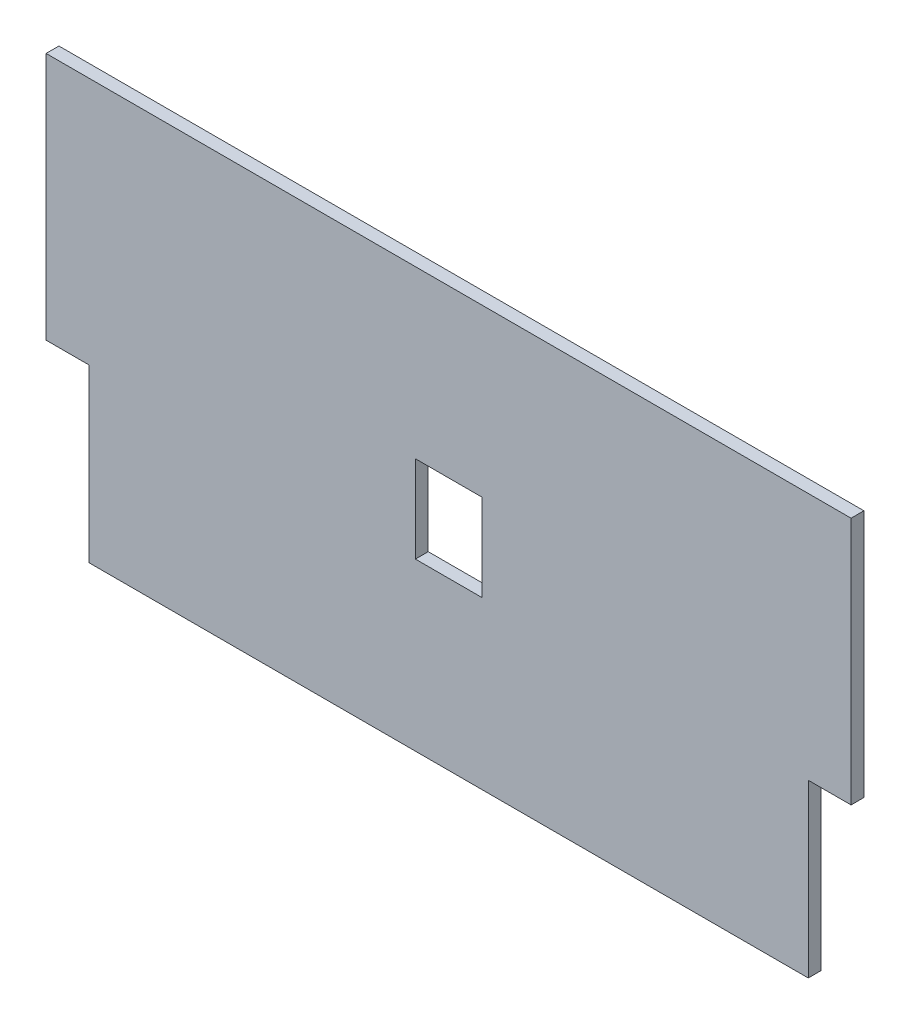
ISO-10303-21;
HEADER;
FILE_DESCRIPTION(('STEP AP214'),'2;1');
FILE_NAME('part.step','',(''),(''),'','','');
FILE_SCHEMA(('AUTOMOTIVE_DESIGN { 1 0 10303 214 1 1 1 1 }'));
ENDSEC;
DATA;
#1=APPLICATION_CONTEXT('core data for automotive mechanical design processes');
#2=APPLICATION_PROTOCOL_DEFINITION('international standard','automotive_design',2000,#1);
#3=PRODUCT_CONTEXT('',#1,'mechanical');
#4=PRODUCT('Part','Part','',(#3));
#5=PRODUCT_RELATED_PRODUCT_CATEGORY('part','',(#4));
#6=PRODUCT_DEFINITION_FORMATION('','',#4);
#7=PRODUCT_DEFINITION_CONTEXT('part definition',#1,'design');
#8=PRODUCT_DEFINITION('design','',#6,#7);
#9=PRODUCT_DEFINITION_SHAPE('','',#8);
#10=(LENGTH_UNIT() NAMED_UNIT(*) SI_UNIT(.MILLI.,.METRE.));
#11=(NAMED_UNIT(*) PLANE_ANGLE_UNIT() SI_UNIT($,.RADIAN.));
#12=(NAMED_UNIT(*) SI_UNIT($,.STERADIAN.) SOLID_ANGLE_UNIT());
#13=UNCERTAINTY_MEASURE_WITH_UNIT(LENGTH_MEASURE(1.E-05),#10,'distance_accuracy_value','');
#14=(GEOMETRIC_REPRESENTATION_CONTEXT(3) GLOBAL_UNCERTAINTY_ASSIGNED_CONTEXT((#13)) GLOBAL_UNIT_ASSIGNED_CONTEXT((#10,
#11,#12)) REPRESENTATION_CONTEXT('',''));
#15=CARTESIAN_POINT('',(0.,0.,0.));
#16=DIRECTION('',(0.,0.,1.));
#17=DIRECTION('',(1.,0.,0.));
#18=AXIS2_PLACEMENT_3D('',#15,#16,#17);
#19=CARTESIAN_POINT('',(94.,0.,1.5));
#20=DIRECTION('',(-1.,0.,0.));
#21=DIRECTION('',(0.,-1.,0.));
#22=AXIS2_PLACEMENT_3D('',#19,#20,#21);
#23=PLANE('',#22);
#24=DIRECTION('',(0.,1.,0.));
#25=VECTOR('',#24,1.);
#26=CARTESIAN_POINT('',(94.,0.,-1.5));
#27=LINE('',#26,#25);
#28=CARTESIAN_POINT('',(94.,-58.,-1.5));
#29=VERTEX_POINT('',#28);
#30=CARTESIAN_POINT('',(94.,0.,-1.5));
#31=VERTEX_POINT('',#30);
#32=EDGE_CURVE('E173',#29,#31,#27,.T.);
#33=ORIENTED_EDGE('',*,*,#32,.T.);
#34=DIRECTION('',(0.,0.,-1.));
#35=VECTOR('',#34,1.);
#36=CARTESIAN_POINT('',(94.,0.,1.5));
#37=LINE('',#36,#35);
#38=CARTESIAN_POINT('',(94.,0.,1.5));
#39=VERTEX_POINT('',#38);
#40=EDGE_CURVE('E11',#39,#31,#37,.T.);
#41=ORIENTED_EDGE('',*,*,#40,.F.);
#42=DIRECTION('',(0.,1.,0.));
#43=VECTOR('',#42,1.);
#44=CARTESIAN_POINT('',(94.,0.,1.5));
#45=LINE('',#44,#43);
#46=CARTESIAN_POINT('',(94.,-58.,1.5));
#47=VERTEX_POINT('',#46);
#48=EDGE_CURVE('E179',#47,#39,#45,.T.);
#49=ORIENTED_EDGE('',*,*,#48,.F.);
#50=DIRECTION('',(0.,0.,-1.));
#51=VECTOR('',#50,1.);
#52=CARTESIAN_POINT('',(94.,-58.,1.5));
#53=LINE('',#52,#51);
#54=EDGE_CURVE('E205',#47,#29,#53,.T.);
#55=ORIENTED_EDGE('',*,*,#54,.T.);
#56=EDGE_LOOP('',(#33,#41,#49,#55));
#57=FACE_BOUND('',#56,.T.);
#58=ADVANCED_FACE('F41',(#57),#23,.F.);
#59=CARTESIAN_POINT('',(-94.,0.,1.5));
#60=DIRECTION('',(0.,-1.,0.));
#61=DIRECTION('',(1.,0.,0.));
#62=AXIS2_PLACEMENT_3D('',#59,#60,#61);
#63=PLANE('',#62);
#64=DIRECTION('',(-1.,0.,0.));
#65=VECTOR('',#64,1.);
#66=CARTESIAN_POINT('',(-94.,0.,-1.5));
#67=LINE('',#66,#65);
#68=CARTESIAN_POINT('',(-94.,0.,-1.5));
#69=VERTEX_POINT('',#68);
#70=EDGE_CURVE('E209',#31,#69,#67,.T.);
#71=ORIENTED_EDGE('',*,*,#70,.T.);
#72=DIRECTION('',(0.,0.,-1.));
#73=VECTOR('',#72,1.);
#74=CARTESIAN_POINT('',(-94.,0.,1.5));
#75=LINE('',#74,#73);
#76=CARTESIAN_POINT('',(-94.,0.,1.5));
#77=VERTEX_POINT('',#76);
#78=EDGE_CURVE('E49',#77,#69,#75,.T.);
#79=ORIENTED_EDGE('',*,*,#78,.F.);
#80=DIRECTION('',(-1.,0.,0.));
#81=VECTOR('',#80,1.);
#82=CARTESIAN_POINT('',(-94.,0.,1.5));
#83=LINE('',#82,#81);
#84=EDGE_CURVE('E183',#39,#77,#83,.T.);
#85=ORIENTED_EDGE('',*,*,#84,.F.);
#86=ORIENTED_EDGE('',*,*,#40,.T.);
#87=EDGE_LOOP('',(#71,#79,#85,#86));
#88=FACE_BOUND('',#87,.T.);
#89=ADVANCED_FACE('F278',(#88),#63,.F.);
#90=CARTESIAN_POINT('',(-94.,0.,1.5));
#91=DIRECTION('',(1.,0.,0.));
#92=DIRECTION('',(0.,1.,0.));
#93=AXIS2_PLACEMENT_3D('',#90,#91,#92);
#94=PLANE('',#93);
#95=DIRECTION('',(0.,-1.,0.));
#96=VECTOR('',#95,1.);
#97=CARTESIAN_POINT('',(-94.,0.,-1.5));
#98=LINE('',#97,#96);
#99=CARTESIAN_POINT('',(-94.,-58.,-1.5));
#100=VERTEX_POINT('',#99);
#101=EDGE_CURVE('E212',#69,#100,#98,.T.);
#102=ORIENTED_EDGE('',*,*,#101,.T.);
#103=DIRECTION('',(0.,0.,-1.));
#104=VECTOR('',#103,1.);
#105=CARTESIAN_POINT('',(-94.,-58.,1.5));
#106=LINE('',#105,#104);
#107=CARTESIAN_POINT('',(-94.,-58.,1.5));
#108=VERTEX_POINT('',#107);
#109=EDGE_CURVE('E248',#108,#100,#106,.T.);
#110=ORIENTED_EDGE('',*,*,#109,.F.);
#111=DIRECTION('',(0.,-1.,0.));
#112=VECTOR('',#111,1.);
#113=CARTESIAN_POINT('',(-94.,0.,1.5));
#114=LINE('',#113,#112);
#115=EDGE_CURVE('E187',#77,#108,#114,.T.);
#116=ORIENTED_EDGE('',*,*,#115,.F.);
#117=ORIENTED_EDGE('',*,*,#78,.T.);
#118=EDGE_LOOP('',(#102,#110,#116,#117));
#119=FACE_BOUND('',#118,.T.);
#120=ADVANCED_FACE('F257',(#119),#94,.F.);
#121=CARTESIAN_POINT('',(-94.,-58.,1.5));
#122=DIRECTION('',(0.,1.,0.));
#123=DIRECTION('',(0.,0.,1.));
#124=AXIS2_PLACEMENT_3D('',#121,#122,#123);
#125=PLANE('',#124);
#126=DIRECTION('',(1.,0.,0.));
#127=VECTOR('',#126,1.);
#128=CARTESIAN_POINT('',(-94.,-58.,-1.5));
#129=LINE('',#128,#127);
#130=CARTESIAN_POINT('',(-84.,-58.,-1.5));
#131=VERTEX_POINT('',#130);
#132=EDGE_CURVE('E215',#100,#131,#129,.T.);
#133=ORIENTED_EDGE('',*,*,#132,.T.);
#134=DIRECTION('',(0.,0.,-1.));
#135=VECTOR('',#134,1.);
#136=CARTESIAN_POINT('',(-84.,-58.,1.5));
#137=LINE('',#136,#135);
#138=CARTESIAN_POINT('',(-84.,-58.,1.5));
#139=VERTEX_POINT('',#138);
#140=EDGE_CURVE('E244',#139,#131,#137,.T.);
#141=ORIENTED_EDGE('',*,*,#140,.F.);
#142=DIRECTION('',(1.,0.,0.));
#143=VECTOR('',#142,1.);
#144=CARTESIAN_POINT('',(-94.,-58.,1.5));
#145=LINE('',#144,#143);
#146=EDGE_CURVE('E190',#108,#139,#145,.T.);
#147=ORIENTED_EDGE('',*,*,#146,.F.);
#148=ORIENTED_EDGE('',*,*,#109,.T.);
#149=EDGE_LOOP('',(#133,#141,#147,#148));
#150=FACE_BOUND('',#149,.T.);
#151=ADVANCED_FACE('F266',(#150),#125,.F.);
#152=CARTESIAN_POINT('',(-84.,-58.,1.5));
#153=DIRECTION('',(1.,0.,0.));
#154=DIRECTION('',(0.,1.,0.));
#155=AXIS2_PLACEMENT_3D('',#152,#153,#154);
#156=PLANE('',#155);
#157=DIRECTION('',(0.,-1.,0.));
#158=VECTOR('',#157,1.);
#159=CARTESIAN_POINT('',(-84.,-58.,-1.5));
#160=LINE('',#159,#158);
#161=CARTESIAN_POINT('',(-84.,-98.,-1.5));
#162=VERTEX_POINT('',#161);
#163=EDGE_CURVE('E218',#131,#162,#160,.T.);
#164=ORIENTED_EDGE('',*,*,#163,.T.);
#165=DIRECTION('',(0.,0.,-1.));
#166=VECTOR('',#165,1.);
#167=CARTESIAN_POINT('',(-84.,-98.,1.5));
#168=LINE('',#167,#166);
#169=CARTESIAN_POINT('',(-84.,-98.,1.5));
#170=VERTEX_POINT('',#169);
#171=EDGE_CURVE('E240',#170,#162,#168,.T.);
#172=ORIENTED_EDGE('',*,*,#171,.F.);
#173=DIRECTION('',(0.,-1.,0.));
#174=VECTOR('',#173,1.);
#175=CARTESIAN_POINT('',(-84.,-58.,1.5));
#176=LINE('',#175,#174);
#177=EDGE_CURVE('E193',#139,#170,#176,.T.);
#178=ORIENTED_EDGE('',*,*,#177,.F.);
#179=ORIENTED_EDGE('',*,*,#140,.T.);
#180=EDGE_LOOP('',(#164,#172,#178,#179));
#181=FACE_BOUND('',#180,.T.);
#182=ADVANCED_FACE('F270',(#181),#156,.F.);
#183=CARTESIAN_POINT('',(84.,-98.,1.5));
#184=DIRECTION('',(0.,1.,0.));
#185=DIRECTION('',(-1.,0.,0.));
#186=AXIS2_PLACEMENT_3D('',#183,#184,#185);
#187=PLANE('',#186);
#188=DIRECTION('',(1.,0.,0.));
#189=VECTOR('',#188,1.);
#190=CARTESIAN_POINT('',(84.,-98.,-1.5));
#191=LINE('',#190,#189);
#192=CARTESIAN_POINT('',(84.,-98.,-1.5));
#193=VERTEX_POINT('',#192);
#194=EDGE_CURVE('E221',#162,#193,#191,.T.);
#195=ORIENTED_EDGE('',*,*,#194,.T.);
#196=DIRECTION('',(0.,0.,-1.));
#197=VECTOR('',#196,1.);
#198=CARTESIAN_POINT('',(84.,-98.,1.5));
#199=LINE('',#198,#197);
#200=CARTESIAN_POINT('',(84.,-98.,1.5));
#201=VERTEX_POINT('',#200);
#202=EDGE_CURVE('E236',#201,#193,#199,.T.);
#203=ORIENTED_EDGE('',*,*,#202,.F.);
#204=DIRECTION('',(1.,0.,0.));
#205=VECTOR('',#204,1.);
#206=CARTESIAN_POINT('',(84.,-98.,1.5));
#207=LINE('',#206,#205);
#208=EDGE_CURVE('E196',#170,#201,#207,.T.);
#209=ORIENTED_EDGE('',*,*,#208,.F.);
#210=ORIENTED_EDGE('',*,*,#171,.T.);
#211=EDGE_LOOP('',(#195,#203,#209,#210));
#212=FACE_BOUND('',#211,.T.);
#213=ADVANCED_FACE('F291',(#212),#187,.F.);
#214=CARTESIAN_POINT('',(84.,-58.,1.5));
#215=DIRECTION('',(-1.,0.,0.));
#216=DIRECTION('',(0.,-1.,0.));
#217=AXIS2_PLACEMENT_3D('',#214,#215,#216);
#218=PLANE('',#217);
#219=DIRECTION('',(0.,1.,0.));
#220=VECTOR('',#219,1.);
#221=CARTESIAN_POINT('',(84.,-58.,-1.5));
#222=LINE('',#221,#220);
#223=CARTESIAN_POINT('',(84.,-58.,-1.5));
#224=VERTEX_POINT('',#223);
#225=EDGE_CURVE('E224',#193,#224,#222,.T.);
#226=ORIENTED_EDGE('',*,*,#225,.T.);
#227=DIRECTION('',(0.,0.,-1.));
#228=VECTOR('',#227,1.);
#229=CARTESIAN_POINT('',(84.,-58.,1.5));
#230=LINE('',#229,#228);
#231=CARTESIAN_POINT('',(84.,-58.,1.5));
#232=VERTEX_POINT('',#231);
#233=EDGE_CURVE('E232',#232,#224,#230,.T.);
#234=ORIENTED_EDGE('',*,*,#233,.F.);
#235=DIRECTION('',(0.,1.,0.));
#236=VECTOR('',#235,1.);
#237=CARTESIAN_POINT('',(84.,-58.,1.5));
#238=LINE('',#237,#236);
#239=EDGE_CURVE('E199',#201,#232,#238,.T.);
#240=ORIENTED_EDGE('',*,*,#239,.F.);
#241=ORIENTED_EDGE('',*,*,#202,.T.);
#242=EDGE_LOOP('',(#226,#234,#240,#241));
#243=FACE_BOUND('',#242,.T.);
#244=ADVANCED_FACE('F289',(#243),#218,.F.);
#245=CARTESIAN_POINT('',(94.,-58.,1.5));
#246=DIRECTION('',(0.,1.,0.));
#247=DIRECTION('',(0.,0.,1.));
#248=AXIS2_PLACEMENT_3D('',#245,#246,#247);
#249=PLANE('',#248);
#250=DIRECTION('',(1.,0.,0.));
#251=VECTOR('',#250,1.);
#252=CARTESIAN_POINT('',(94.,-58.,-1.5));
#253=LINE('',#252,#251);
#254=EDGE_CURVE('E184',#224,#29,#253,.T.);
#255=ORIENTED_EDGE('',*,*,#254,.T.);
#256=ORIENTED_EDGE('',*,*,#54,.F.);
#257=DIRECTION('',(1.,0.,0.));
#258=VECTOR('',#257,1.);
#259=CARTESIAN_POINT('',(94.,-58.,1.5));
#260=LINE('',#259,#258);
#261=EDGE_CURVE('E202',#232,#47,#260,.T.);
#262=ORIENTED_EDGE('',*,*,#261,.F.);
#263=ORIENTED_EDGE('',*,*,#233,.T.);
#264=EDGE_LOOP('',(#255,#256,#262,#263));
#265=FACE_BOUND('',#264,.T.);
#266=ADVANCED_FACE('F284',(#265),#249,.F.);
#267=CARTESIAN_POINT('',(0.,0.,1.5));
#268=DIRECTION('',(0.,0.,-1.));
#269=DIRECTION('',(-1.,0.,0.));
#270=AXIS2_PLACEMENT_3D('',#267,#268,#269);
#271=PLANE('',#270);
#272=DIRECTION('',(-1.,0.,0.));
#273=VECTOR('',#272,1.);
#274=CARTESIAN_POINT('',(-7.74999999999999,-38.85,1.5));
#275=LINE('',#274,#273);
#276=CARTESIAN_POINT('',(7.75,-38.85,1.5));
#277=VERTEX_POINT('',#276);
#278=CARTESIAN_POINT('',(-7.74999999999999,-38.85,1.5));
#279=VERTEX_POINT('',#278);
#280=EDGE_CURVE('E164',#277,#279,#275,.T.);
#281=ORIENTED_EDGE('',*,*,#280,.F.);
#282=DIRECTION('',(0.,1.,0.));
#283=VECTOR('',#282,1.);
#284=CARTESIAN_POINT('',(7.75,-38.85,1.5));
#285=LINE('',#284,#283);
#286=CARTESIAN_POINT('',(7.75000000000001,-59.15,1.5));
#287=VERTEX_POINT('',#286);
#288=EDGE_CURVE('E56',#287,#277,#285,.T.);
#289=ORIENTED_EDGE('',*,*,#288,.F.);
#290=DIRECTION('',(1.,0.,0.));
#291=VECTOR('',#290,1.);
#292=CARTESIAN_POINT('',(-7.74999999999999,-59.15,1.5));
#293=LINE('',#292,#291);
#294=CARTESIAN_POINT('',(-7.74999999999999,-59.15,1.5));
#295=VERTEX_POINT('',#294);
#296=EDGE_CURVE('E151',#295,#287,#293,.T.);
#297=ORIENTED_EDGE('',*,*,#296,.F.);
#298=DIRECTION('',(0.,-1.,0.));
#299=VECTOR('',#298,1.);
#300=CARTESIAN_POINT('',(-7.74999999999999,-38.85,1.5));
#301=LINE('',#300,#299);
#302=EDGE_CURVE('E155',#279,#295,#301,.T.);
#303=ORIENTED_EDGE('',*,*,#302,.F.);
#304=EDGE_LOOP('',(#281,#289,#297,#303));
#305=FACE_BOUND('',#304,.T.);
#306=ORIENTED_EDGE('',*,*,#48,.T.);
#307=ORIENTED_EDGE('',*,*,#84,.T.);
#308=ORIENTED_EDGE('',*,*,#115,.T.);
#309=ORIENTED_EDGE('',*,*,#146,.T.);
#310=ORIENTED_EDGE('',*,*,#177,.T.);
#311=ORIENTED_EDGE('',*,*,#208,.T.);
#312=ORIENTED_EDGE('',*,*,#239,.T.);
#313=ORIENTED_EDGE('',*,*,#261,.T.);
#314=EDGE_LOOP('',(#306,#307,#308,#309,#310,#311,#312,#313));
#315=FACE_BOUND('',#314,.T.);
#316=ADVANCED_FACE('F274',(#305,#315),#271,.F.);
#317=CARTESIAN_POINT('',(0.,0.,-1.5));
#318=DIRECTION('',(0.,0.,-1.));
#319=DIRECTION('',(-1.,0.,0.));
#320=AXIS2_PLACEMENT_3D('',#317,#318,#319);
#321=PLANE('',#320);
#322=DIRECTION('',(0.,1.,0.));
#323=VECTOR('',#322,1.);
#324=CARTESIAN_POINT('',(7.75,-38.85,-1.5));
#325=LINE('',#324,#323);
#326=CARTESIAN_POINT('',(7.75000000000001,-59.15,-1.5));
#327=VERTEX_POINT('',#326);
#328=CARTESIAN_POINT('',(7.75,-38.85,-1.5));
#329=VERTEX_POINT('',#328);
#330=EDGE_CURVE('E132',#327,#329,#325,.T.);
#331=ORIENTED_EDGE('',*,*,#330,.T.);
#332=DIRECTION('',(-1.,0.,0.));
#333=VECTOR('',#332,1.);
#334=CARTESIAN_POINT('',(-7.74999999999999,-38.85,-1.5));
#335=LINE('',#334,#333);
#336=CARTESIAN_POINT('',(-7.74999999999999,-38.85,-1.5));
#337=VERTEX_POINT('',#336);
#338=EDGE_CURVE('E142',#329,#337,#335,.T.);
#339=ORIENTED_EDGE('',*,*,#338,.T.);
#340=DIRECTION('',(0.,-1.,0.));
#341=VECTOR('',#340,1.);
#342=CARTESIAN_POINT('',(-7.74999999999999,-38.85,-1.5));
#343=LINE('',#342,#341);
#344=CARTESIAN_POINT('',(-7.74999999999999,-59.15,-1.5));
#345=VERTEX_POINT('',#344);
#346=EDGE_CURVE('E64',#337,#345,#343,.T.);
#347=ORIENTED_EDGE('',*,*,#346,.T.);
#348=DIRECTION('',(1.,0.,0.));
#349=VECTOR('',#348,1.);
#350=CARTESIAN_POINT('',(-7.74999999999999,-59.15,-1.5));
#351=LINE('',#350,#349);
#352=EDGE_CURVE('E139',#345,#327,#351,.T.);
#353=ORIENTED_EDGE('',*,*,#352,.T.);
#354=EDGE_LOOP('',(#331,#339,#347,#353));
#355=FACE_BOUND('',#354,.T.);
#356=ORIENTED_EDGE('',*,*,#32,.F.);
#357=ORIENTED_EDGE('',*,*,#254,.F.);
#358=ORIENTED_EDGE('',*,*,#225,.F.);
#359=ORIENTED_EDGE('',*,*,#194,.F.);
#360=ORIENTED_EDGE('',*,*,#163,.F.);
#361=ORIENTED_EDGE('',*,*,#132,.F.);
#362=ORIENTED_EDGE('',*,*,#101,.F.);
#363=ORIENTED_EDGE('',*,*,#70,.F.);
#364=EDGE_LOOP('',(#356,#357,#358,#359,#360,#361,#362,#363));
#365=FACE_BOUND('',#364,.T.);
#366=ADVANCED_FACE('F147',(#355,#365),#321,.T.);
#367=CARTESIAN_POINT('',(7.75,-38.85,-1.5));
#368=DIRECTION('',(1.,0.,0.));
#369=DIRECTION('',(0.,1.,0.));
#370=AXIS2_PLACEMENT_3D('',#367,#368,#369);
#371=PLANE('',#370);
#372=ORIENTED_EDGE('',*,*,#288,.T.);
#373=DIRECTION('',(0.,0.,1.));
#374=VECTOR('',#373,1.);
#375=CARTESIAN_POINT('',(7.75,-38.85,-1.5));
#376=LINE('',#375,#374);
#377=EDGE_CURVE('E128',#329,#277,#376,.T.);
#378=ORIENTED_EDGE('',*,*,#377,.F.);
#379=ORIENTED_EDGE('',*,*,#330,.F.);
#380=DIRECTION('',(0.,0.,1.));
#381=VECTOR('',#380,1.);
#382=CARTESIAN_POINT('',(7.75000000000001,-59.15,-1.5));
#383=LINE('',#382,#381);
#384=EDGE_CURVE('E170',#327,#287,#383,.T.);
#385=ORIENTED_EDGE('',*,*,#384,.T.);
#386=EDGE_LOOP('',(#372,#378,#379,#385));
#387=FACE_BOUND('',#386,.T.);
#388=ADVANCED_FACE('F130',(#387),#371,.F.);
#389=CARTESIAN_POINT('',(-7.74999999999999,-59.15,-1.5));
#390=DIRECTION('',(0.,-1.,0.));
#391=DIRECTION('',(0.,0.,-1.));
#392=AXIS2_PLACEMENT_3D('',#389,#390,#391);
#393=PLANE('',#392);
#394=ORIENTED_EDGE('',*,*,#296,.T.);
#395=ORIENTED_EDGE('',*,*,#384,.F.);
#396=ORIENTED_EDGE('',*,*,#352,.F.);
#397=DIRECTION('',(0.,0.,1.));
#398=VECTOR('',#397,1.);
#399=CARTESIAN_POINT('',(-7.74999999999999,-59.15,-1.5));
#400=LINE('',#399,#398);
#401=EDGE_CURVE('E174',#345,#295,#400,.T.);
#402=ORIENTED_EDGE('',*,*,#401,.T.);
#403=EDGE_LOOP('',(#394,#395,#396,#402));
#404=FACE_BOUND('',#403,.T.);
#405=ADVANCED_FACE('F362',(#404),#393,.F.);
#406=CARTESIAN_POINT('',(-7.74999999999999,-38.85,-1.5));
#407=DIRECTION('',(-1.,0.,0.));
#408=DIRECTION('',(0.,-1.,0.));
#409=AXIS2_PLACEMENT_3D('',#406,#407,#408);
#410=PLANE('',#409);
#411=ORIENTED_EDGE('',*,*,#302,.T.);
#412=ORIENTED_EDGE('',*,*,#401,.F.);
#413=ORIENTED_EDGE('',*,*,#346,.F.);
#414=DIRECTION('',(0.,0.,1.));
#415=VECTOR('',#414,1.);
#416=CARTESIAN_POINT('',(-7.74999999999999,-38.85,-1.5));
#417=LINE('',#416,#415);
#418=EDGE_CURVE('E138',#337,#279,#417,.T.);
#419=ORIENTED_EDGE('',*,*,#418,.T.);
#420=EDGE_LOOP('',(#411,#412,#413,#419));
#421=FACE_BOUND('',#420,.T.);
#422=ADVANCED_FACE('F371',(#421),#410,.F.);
#423=CARTESIAN_POINT('',(-7.74999999999999,-38.85,-1.5));
#424=DIRECTION('',(0.,1.,0.));
#425=DIRECTION('',(0.,0.,1.));
#426=AXIS2_PLACEMENT_3D('',#423,#424,#425);
#427=PLANE('',#426);
#428=ORIENTED_EDGE('',*,*,#280,.T.);
#429=ORIENTED_EDGE('',*,*,#418,.F.);
#430=ORIENTED_EDGE('',*,*,#338,.F.);
#431=ORIENTED_EDGE('',*,*,#377,.T.);
#432=EDGE_LOOP('',(#428,#429,#430,#431));
#433=FACE_BOUND('',#432,.T.);
#434=ADVANCED_FACE('F143',(#433),#427,.F.);
#435=CLOSED_SHELL('',(#58,#89,#120,#151,#182,#213,#244,#266,#316,#366,#388,#405,#422,#434));
#436=MANIFOLD_SOLID_BREP('B2',#435);
#437=ADVANCED_BREP_SHAPE_REPRESENTATION('',(#18,#436),#14);
#438=SHAPE_DEFINITION_REPRESENTATION(#9,#437);
ENDSEC;
END-ISO-10303-21;
